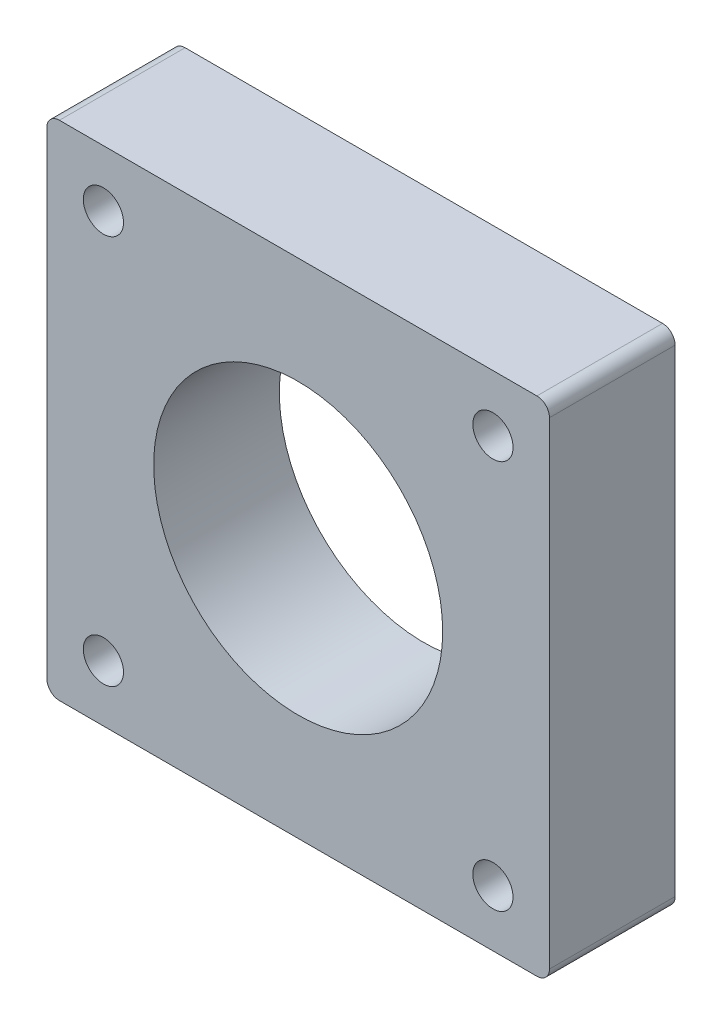
ISO-10303-21;
HEADER;
FILE_DESCRIPTION(('STEP AP214'),'2;1');
FILE_NAME('part.step','',(''),(''),'','','');
FILE_SCHEMA(('AUTOMOTIVE_DESIGN { 1 0 10303 214 1 1 1 1 }'));
ENDSEC;
DATA;
#1=APPLICATION_CONTEXT('core data for automotive mechanical design processes');
#2=APPLICATION_PROTOCOL_DEFINITION('international standard','automotive_design',2000,#1);
#3=PRODUCT_CONTEXT('',#1,'mechanical');
#4=PRODUCT('Part','Part','',(#3));
#5=PRODUCT_RELATED_PRODUCT_CATEGORY('part','',(#4));
#6=PRODUCT_DEFINITION_FORMATION('','',#4);
#7=PRODUCT_DEFINITION_CONTEXT('part definition',#1,'design');
#8=PRODUCT_DEFINITION('design','',#6,#7);
#9=PRODUCT_DEFINITION_SHAPE('','',#8);
#10=(LENGTH_UNIT() NAMED_UNIT(*) SI_UNIT(.MILLI.,.METRE.));
#11=(NAMED_UNIT(*) PLANE_ANGLE_UNIT() SI_UNIT($,.RADIAN.));
#12=(NAMED_UNIT(*) SI_UNIT($,.STERADIAN.) SOLID_ANGLE_UNIT());
#13=UNCERTAINTY_MEASURE_WITH_UNIT(LENGTH_MEASURE(1.E-05),#10,'distance_accuracy_value','');
#14=(GEOMETRIC_REPRESENTATION_CONTEXT(3) GLOBAL_UNCERTAINTY_ASSIGNED_CONTEXT((#13)) GLOBAL_UNIT_ASSIGNED_CONTEXT((#10,
#11,#12)) REPRESENTATION_CONTEXT('',''));
#15=CARTESIAN_POINT('',(0.,0.,0.));
#16=DIRECTION('',(0.,0.,1.));
#17=DIRECTION('',(1.,0.,0.));
#18=AXIS2_PLACEMENT_3D('',#15,#16,#17);
#19=CARTESIAN_POINT('',(-19.,-19.,10.));
#20=DIRECTION('',(0.,0.,1.));
#21=DIRECTION('',(1.,0.,0.));
#22=AXIS2_PLACEMENT_3D('',#19,#20,#21);
#23=PLANE('',#22);
#24=CARTESIAN_POINT('',(15.5,-15.5,10.));
#25=DIRECTION('',(0.,0.,1.));
#26=DIRECTION('',(1.,0.,0.));
#27=AXIS2_PLACEMENT_3D('',#24,#25,#26);
#28=CIRCLE('',#27,1.6);
#29=CARTESIAN_POINT('',(17.1,-15.5,10.));
#30=VERTEX_POINT('',#29);
#31=EDGE_CURVE('E194',#30,#30,#28,.T.);
#32=ORIENTED_EDGE('',*,*,#31,.F.);
#33=EDGE_LOOP('',(#32));
#34=FACE_BOUND('',#33,.T.);
#35=CARTESIAN_POINT('',(-15.5,15.5,10.));
#36=DIRECTION('',(0.,0.,1.));
#37=DIRECTION('',(1.,0.,0.));
#38=AXIS2_PLACEMENT_3D('',#35,#36,#37);
#39=CIRCLE('',#38,1.6);
#40=CARTESIAN_POINT('',(-13.9,15.5,10.));
#41=VERTEX_POINT('',#40);
#42=EDGE_CURVE('E182',#41,#41,#39,.T.);
#43=ORIENTED_EDGE('',*,*,#42,.F.);
#44=EDGE_LOOP('',(#43));
#45=FACE_BOUND('',#44,.T.);
#46=CARTESIAN_POINT('',(-19.,-19.,10.));
#47=DIRECTION('',(0.,0.,1.));
#48=DIRECTION('',(1.,0.,0.));
#49=AXIS2_PLACEMENT_3D('',#46,#47,#48);
#50=CIRCLE('',#49,1.);
#51=CARTESIAN_POINT('',(-20.,-19.,10.));
#52=VERTEX_POINT('',#51);
#53=CARTESIAN_POINT('',(-19.,-20.,10.));
#54=VERTEX_POINT('',#53);
#55=EDGE_CURVE('E145',#52,#54,#50,.T.);
#56=ORIENTED_EDGE('',*,*,#55,.T.);
#57=DIRECTION('',(1.,0.,0.));
#58=VECTOR('',#57,1.);
#59=CARTESIAN_POINT('',(-19.,-20.,10.));
#60=LINE('',#59,#58);
#61=CARTESIAN_POINT('',(19.,-20.,10.));
#62=VERTEX_POINT('',#61);
#63=EDGE_CURVE('E93',#54,#62,#60,.T.);
#64=ORIENTED_EDGE('',*,*,#63,.T.);
#65=CARTESIAN_POINT('',(19.,-19.,10.));
#66=DIRECTION('',(0.,0.,1.));
#67=DIRECTION('',(1.,0.,0.));
#68=AXIS2_PLACEMENT_3D('',#65,#66,#67);
#69=CIRCLE('',#68,1.);
#70=CARTESIAN_POINT('',(20.,-19.,10.));
#71=VERTEX_POINT('',#70);
#72=EDGE_CURVE('E160',#62,#71,#69,.T.);
#73=ORIENTED_EDGE('',*,*,#72,.T.);
#74=DIRECTION('',(0.,1.,0.));
#75=VECTOR('',#74,1.);
#76=CARTESIAN_POINT('',(20.,19.,10.));
#77=LINE('',#76,#75);
#78=CARTESIAN_POINT('',(20.,19.,10.));
#79=VERTEX_POINT('',#78);
#80=EDGE_CURVE('E173',#71,#79,#77,.T.);
#81=ORIENTED_EDGE('',*,*,#80,.T.);
#82=CARTESIAN_POINT('',(19.,19.,10.));
#83=DIRECTION('',(0.,0.,1.));
#84=DIRECTION('',(1.,0.,0.));
#85=AXIS2_PLACEMENT_3D('',#82,#83,#84);
#86=CIRCLE('',#85,1.);
#87=CARTESIAN_POINT('',(19.,20.,10.));
#88=VERTEX_POINT('',#87);
#89=EDGE_CURVE('E112',#79,#88,#86,.T.);
#90=ORIENTED_EDGE('',*,*,#89,.T.);
#91=DIRECTION('',(-1.,0.,0.));
#92=VECTOR('',#91,1.);
#93=CARTESIAN_POINT('',(-19.,20.,10.));
#94=LINE('',#93,#92);
#95=CARTESIAN_POINT('',(-19.,20.,10.));
#96=VERTEX_POINT('',#95);
#97=EDGE_CURVE('E106',#88,#96,#94,.T.);
#98=ORIENTED_EDGE('',*,*,#97,.T.);
#99=CARTESIAN_POINT('',(-19.,19.,10.));
#100=DIRECTION('',(0.,0.,1.));
#101=DIRECTION('',(-1.,0.,0.));
#102=AXIS2_PLACEMENT_3D('',#99,#100,#101);
#103=CIRCLE('',#102,1.);
#104=CARTESIAN_POINT('',(-20.,19.,10.));
#105=VERTEX_POINT('',#104);
#106=EDGE_CURVE('E110',#96,#105,#103,.T.);
#107=ORIENTED_EDGE('',*,*,#106,.T.);
#108=DIRECTION('',(0.,-1.,0.));
#109=VECTOR('',#108,1.);
#110=CARTESIAN_POINT('',(-20.,19.,10.));
#111=LINE('',#110,#109);
#112=EDGE_CURVE('E50',#105,#52,#111,.T.);
#113=ORIENTED_EDGE('',*,*,#112,.T.);
#114=EDGE_LOOP('',(#56,#64,#73,#81,#90,#98,#107,#113));
#115=FACE_BOUND('',#114,.T.);
#116=CARTESIAN_POINT('',(0.,0.,10.));
#117=DIRECTION('',(0.,0.,1.));
#118=DIRECTION('',(1.,0.,0.));
#119=AXIS2_PLACEMENT_3D('',#116,#117,#118);
#120=CIRCLE('',#119,11.5);
#121=CARTESIAN_POINT('',(11.5,0.,10.));
#122=VERTEX_POINT('',#121);
#123=EDGE_CURVE('E134',#122,#122,#120,.T.);
#124=ORIENTED_EDGE('',*,*,#123,.F.);
#125=EDGE_LOOP('',(#124));
#126=FACE_BOUND('',#125,.T.);
#127=CARTESIAN_POINT('',(15.5,15.5,10.));
#128=DIRECTION('',(0.,0.,1.));
#129=DIRECTION('',(1.,0.,0.));
#130=AXIS2_PLACEMENT_3D('',#127,#128,#129);
#131=CIRCLE('',#130,1.6);
#132=CARTESIAN_POINT('',(17.1,15.5,10.));
#133=VERTEX_POINT('',#132);
#134=EDGE_CURVE('E188',#133,#133,#131,.T.);
#135=ORIENTED_EDGE('',*,*,#134,.F.);
#136=EDGE_LOOP('',(#135));
#137=FACE_BOUND('',#136,.T.);
#138=CARTESIAN_POINT('',(-15.5,-15.5,10.));
#139=DIRECTION('',(0.,0.,1.));
#140=DIRECTION('',(1.,0.,0.));
#141=AXIS2_PLACEMENT_3D('',#138,#139,#140);
#142=CIRCLE('',#141,1.6);
#143=CARTESIAN_POINT('',(-13.9,-15.5,10.));
#144=VERTEX_POINT('',#143);
#145=EDGE_CURVE('E200',#144,#144,#142,.T.);
#146=ORIENTED_EDGE('',*,*,#145,.F.);
#147=EDGE_LOOP('',(#146));
#148=FACE_BOUND('',#147,.T.);
#149=ADVANCED_FACE('F33',(#34,#45,#115,#126,#137,#148),#23,.T.);
#150=CARTESIAN_POINT('',(-19.,-19.,0.));
#151=DIRECTION('',(0.,0.,1.));
#152=DIRECTION('',(1.,0.,0.));
#153=AXIS2_PLACEMENT_3D('',#150,#151,#152);
#154=PLANE('',#153);
#155=CARTESIAN_POINT('',(15.5,-15.5,0.));
#156=DIRECTION('',(0.,0.,1.));
#157=DIRECTION('',(1.,0.,0.));
#158=AXIS2_PLACEMENT_3D('',#155,#156,#157);
#159=CIRCLE('',#158,1.6);
#160=CARTESIAN_POINT('',(17.1,-15.5,0.));
#161=VERTEX_POINT('',#160);
#162=EDGE_CURVE('E197',#161,#161,#159,.T.);
#163=ORIENTED_EDGE('',*,*,#162,.T.);
#164=EDGE_LOOP('',(#163));
#165=FACE_BOUND('',#164,.T.);
#166=CARTESIAN_POINT('',(-15.5,15.5,0.));
#167=DIRECTION('',(0.,0.,1.));
#168=DIRECTION('',(1.,0.,0.));
#169=AXIS2_PLACEMENT_3D('',#166,#167,#168);
#170=CIRCLE('',#169,1.6);
#171=CARTESIAN_POINT('',(-13.9,15.5,0.));
#172=VERTEX_POINT('',#171);
#173=EDGE_CURVE('E185',#172,#172,#170,.T.);
#174=ORIENTED_EDGE('',*,*,#173,.T.);
#175=EDGE_LOOP('',(#174));
#176=FACE_BOUND('',#175,.T.);
#177=CARTESIAN_POINT('',(-19.,-19.,0.));
#178=DIRECTION('',(0.,0.,1.));
#179=DIRECTION('',(1.,0.,0.));
#180=AXIS2_PLACEMENT_3D('',#177,#178,#179);
#181=CIRCLE('',#180,1.);
#182=CARTESIAN_POINT('',(-20.,-19.,0.));
#183=VERTEX_POINT('',#182);
#184=CARTESIAN_POINT('',(-19.,-20.,0.));
#185=VERTEX_POINT('',#184);
#186=EDGE_CURVE('E130',#183,#185,#181,.T.);
#187=ORIENTED_EDGE('',*,*,#186,.F.);
#188=DIRECTION('',(0.,-1.,0.));
#189=VECTOR('',#188,1.);
#190=CARTESIAN_POINT('',(-20.,19.,0.));
#191=LINE('',#190,#189);
#192=CARTESIAN_POINT('',(-20.,19.,0.));
#193=VERTEX_POINT('',#192);
#194=EDGE_CURVE('E85',#193,#183,#191,.T.);
#195=ORIENTED_EDGE('',*,*,#194,.F.);
#196=CARTESIAN_POINT('',(-19.,19.,0.));
#197=DIRECTION('',(0.,0.,1.));
#198=DIRECTION('',(-1.,0.,0.));
#199=AXIS2_PLACEMENT_3D('',#196,#197,#198);
#200=CIRCLE('',#199,1.);
#201=CARTESIAN_POINT('',(-19.,20.,0.));
#202=VERTEX_POINT('',#201);
#203=EDGE_CURVE('E79',#202,#193,#200,.T.);
#204=ORIENTED_EDGE('',*,*,#203,.F.);
#205=DIRECTION('',(-1.,0.,0.));
#206=VECTOR('',#205,1.);
#207=CARTESIAN_POINT('',(-19.,20.,0.));
#208=LINE('',#207,#206);
#209=CARTESIAN_POINT('',(19.,20.,0.));
#210=VERTEX_POINT('',#209);
#211=EDGE_CURVE('E120',#210,#202,#208,.T.);
#212=ORIENTED_EDGE('',*,*,#211,.F.);
#213=CARTESIAN_POINT('',(19.,19.,0.));
#214=DIRECTION('',(0.,0.,1.));
#215=DIRECTION('',(1.,0.,0.));
#216=AXIS2_PLACEMENT_3D('',#213,#214,#215);
#217=CIRCLE('',#216,1.);
#218=CARTESIAN_POINT('',(20.,19.,0.));
#219=VERTEX_POINT('',#218);
#220=EDGE_CURVE('E140',#219,#210,#217,.T.);
#221=ORIENTED_EDGE('',*,*,#220,.F.);
#222=DIRECTION('',(0.,1.,0.));
#223=VECTOR('',#222,1.);
#224=CARTESIAN_POINT('',(20.,19.,0.));
#225=LINE('',#224,#223);
#226=CARTESIAN_POINT('',(20.,-19.,0.));
#227=VERTEX_POINT('',#226);
#228=EDGE_CURVE('E138',#227,#219,#225,.T.);
#229=ORIENTED_EDGE('',*,*,#228,.F.);
#230=CARTESIAN_POINT('',(19.,-19.,0.));
#231=DIRECTION('',(0.,0.,1.));
#232=DIRECTION('',(1.,0.,0.));
#233=AXIS2_PLACEMENT_3D('',#230,#231,#232);
#234=CIRCLE('',#233,1.);
#235=CARTESIAN_POINT('',(19.,-20.,0.));
#236=VERTEX_POINT('',#235);
#237=EDGE_CURVE('E136',#236,#227,#234,.T.);
#238=ORIENTED_EDGE('',*,*,#237,.F.);
#239=DIRECTION('',(1.,0.,0.));
#240=VECTOR('',#239,1.);
#241=CARTESIAN_POINT('',(-19.,-20.,0.));
#242=LINE('',#241,#240);
#243=EDGE_CURVE('E133',#185,#236,#242,.T.);
#244=ORIENTED_EDGE('',*,*,#243,.F.);
#245=EDGE_LOOP('',(#187,#195,#204,#212,#221,#229,#238,#244));
#246=FACE_BOUND('',#245,.T.);
#247=CARTESIAN_POINT('',(0.,0.,0.));
#248=DIRECTION('',(0.,0.,1.));
#249=DIRECTION('',(1.,0.,0.));
#250=AXIS2_PLACEMENT_3D('',#247,#248,#249);
#251=CIRCLE('',#250,11.5);
#252=CARTESIAN_POINT('',(11.5,0.,0.));
#253=VERTEX_POINT('',#252);
#254=EDGE_CURVE('E179',#253,#253,#251,.T.);
#255=ORIENTED_EDGE('',*,*,#254,.T.);
#256=EDGE_LOOP('',(#255));
#257=FACE_BOUND('',#256,.T.);
#258=CARTESIAN_POINT('',(15.5,15.5,0.));
#259=DIRECTION('',(0.,0.,1.));
#260=DIRECTION('',(1.,0.,0.));
#261=AXIS2_PLACEMENT_3D('',#258,#259,#260);
#262=CIRCLE('',#261,1.6);
#263=CARTESIAN_POINT('',(17.1,15.5,0.));
#264=VERTEX_POINT('',#263);
#265=EDGE_CURVE('E191',#264,#264,#262,.T.);
#266=ORIENTED_EDGE('',*,*,#265,.T.);
#267=EDGE_LOOP('',(#266));
#268=FACE_BOUND('',#267,.T.);
#269=CARTESIAN_POINT('',(-15.5,-15.5,0.));
#270=DIRECTION('',(0.,0.,1.));
#271=DIRECTION('',(1.,0.,0.));
#272=AXIS2_PLACEMENT_3D('',#269,#270,#271);
#273=CIRCLE('',#272,1.6);
#274=CARTESIAN_POINT('',(-13.9,-15.5,0.));
#275=VERTEX_POINT('',#274);
#276=EDGE_CURVE('E203',#275,#275,#273,.T.);
#277=ORIENTED_EDGE('',*,*,#276,.T.);
#278=EDGE_LOOP('',(#277));
#279=FACE_BOUND('',#278,.T.);
#280=ADVANCED_FACE('F164',(#165,#176,#246,#257,#268,#279),#154,.F.);
#281=CARTESIAN_POINT('',(-19.,-19.,10.));
#282=DIRECTION('',(0.,0.,-1.));
#283=DIRECTION('',(-1.,0.,0.));
#284=AXIS2_PLACEMENT_3D('',#281,#282,#283);
#285=CYLINDRICAL_SURFACE('',#284,1.);
#286=ORIENTED_EDGE('',*,*,#186,.T.);
#287=DIRECTION('',(0.,0.,-1.));
#288=VECTOR('',#287,1.);
#289=CARTESIAN_POINT('',(-19.,-20.,10.));
#290=LINE('',#289,#288);
#291=EDGE_CURVE('E11',#54,#185,#290,.T.);
#292=ORIENTED_EDGE('',*,*,#291,.F.);
#293=ORIENTED_EDGE('',*,*,#55,.F.);
#294=DIRECTION('',(0.,0.,-1.));
#295=VECTOR('',#294,1.);
#296=CARTESIAN_POINT('',(-20.,-19.,10.));
#297=LINE('',#296,#295);
#298=EDGE_CURVE('E126',#52,#183,#297,.T.);
#299=ORIENTED_EDGE('',*,*,#298,.T.);
#300=EDGE_LOOP('',(#286,#292,#293,#299));
#301=FACE_BOUND('',#300,.T.);
#302=ADVANCED_FACE('F35',(#301),#285,.T.);
#303=CARTESIAN_POINT('',(-19.,-20.,10.));
#304=DIRECTION('',(0.,1.,0.));
#305=DIRECTION('',(0.,0.,1.));
#306=AXIS2_PLACEMENT_3D('',#303,#304,#305);
#307=PLANE('',#306);
#308=ORIENTED_EDGE('',*,*,#243,.T.);
#309=DIRECTION('',(0.,0.,-1.));
#310=VECTOR('',#309,1.);
#311=CARTESIAN_POINT('',(19.,-20.,10.));
#312=LINE('',#311,#310);
#313=EDGE_CURVE('E42',#62,#236,#312,.T.);
#314=ORIENTED_EDGE('',*,*,#313,.F.);
#315=ORIENTED_EDGE('',*,*,#63,.F.);
#316=ORIENTED_EDGE('',*,*,#291,.T.);
#317=EDGE_LOOP('',(#308,#314,#315,#316));
#318=FACE_BOUND('',#317,.T.);
#319=ADVANCED_FACE('F238',(#318),#307,.F.);
#320=CARTESIAN_POINT('',(19.,-19.,10.));
#321=DIRECTION('',(0.,0.,-1.));
#322=DIRECTION('',(-1.,0.,0.));
#323=AXIS2_PLACEMENT_3D('',#320,#321,#322);
#324=CYLINDRICAL_SURFACE('',#323,1.);
#325=ORIENTED_EDGE('',*,*,#237,.T.);
#326=DIRECTION('',(0.,0.,-1.));
#327=VECTOR('',#326,1.);
#328=CARTESIAN_POINT('',(20.,-19.,10.));
#329=LINE('',#328,#327);
#330=EDGE_CURVE('E152',#71,#227,#329,.T.);
#331=ORIENTED_EDGE('',*,*,#330,.F.);
#332=ORIENTED_EDGE('',*,*,#72,.F.);
#333=ORIENTED_EDGE('',*,*,#313,.T.);
#334=EDGE_LOOP('',(#325,#331,#332,#333));
#335=FACE_BOUND('',#334,.T.);
#336=ADVANCED_FACE('F158',(#335),#324,.T.);
#337=CARTESIAN_POINT('',(20.,19.,10.));
#338=DIRECTION('',(-1.,0.,0.));
#339=DIRECTION('',(0.,0.,1.));
#340=AXIS2_PLACEMENT_3D('',#337,#338,#339);
#341=PLANE('',#340);
#342=ORIENTED_EDGE('',*,*,#228,.T.);
#343=DIRECTION('',(0.,0.,-1.));
#344=VECTOR('',#343,1.);
#345=CARTESIAN_POINT('',(20.,19.,10.));
#346=LINE('',#345,#344);
#347=EDGE_CURVE('E149',#79,#219,#346,.T.);
#348=ORIENTED_EDGE('',*,*,#347,.F.);
#349=ORIENTED_EDGE('',*,*,#80,.F.);
#350=ORIENTED_EDGE('',*,*,#330,.T.);
#351=EDGE_LOOP('',(#342,#348,#349,#350));
#352=FACE_BOUND('',#351,.T.);
#353=ADVANCED_FACE('F169',(#352),#341,.F.);
#354=CARTESIAN_POINT('',(19.,19.,10.));
#355=DIRECTION('',(0.,0.,-1.));
#356=DIRECTION('',(-1.,0.,0.));
#357=AXIS2_PLACEMENT_3D('',#354,#355,#356);
#358=CYLINDRICAL_SURFACE('',#357,1.);
#359=ORIENTED_EDGE('',*,*,#220,.T.);
#360=DIRECTION('',(0.,0.,-1.));
#361=VECTOR('',#360,1.);
#362=CARTESIAN_POINT('',(19.,20.,10.));
#363=LINE('',#362,#361);
#364=EDGE_CURVE('E121',#88,#210,#363,.T.);
#365=ORIENTED_EDGE('',*,*,#364,.F.);
#366=ORIENTED_EDGE('',*,*,#89,.F.);
#367=ORIENTED_EDGE('',*,*,#347,.T.);
#368=EDGE_LOOP('',(#359,#365,#366,#367));
#369=FACE_BOUND('',#368,.T.);
#370=ADVANCED_FACE('F172',(#369),#358,.T.);
#371=CARTESIAN_POINT('',(-19.,20.,10.));
#372=DIRECTION('',(0.,-1.,0.));
#373=DIRECTION('',(0.,0.,-1.));
#374=AXIS2_PLACEMENT_3D('',#371,#372,#373);
#375=PLANE('',#374);
#376=ORIENTED_EDGE('',*,*,#211,.T.);
#377=DIRECTION('',(0.,0.,-1.));
#378=VECTOR('',#377,1.);
#379=CARTESIAN_POINT('',(-19.,20.,10.));
#380=LINE('',#379,#378);
#381=EDGE_CURVE('E117',#96,#202,#380,.T.);
#382=ORIENTED_EDGE('',*,*,#381,.F.);
#383=ORIENTED_EDGE('',*,*,#97,.F.);
#384=ORIENTED_EDGE('',*,*,#364,.T.);
#385=EDGE_LOOP('',(#376,#382,#383,#384));
#386=FACE_BOUND('',#385,.T.);
#387=ADVANCED_FACE('F118',(#386),#375,.F.);
#388=CARTESIAN_POINT('',(-19.,19.,10.));
#389=DIRECTION('',(0.,0.,-1.));
#390=DIRECTION('',(-1.,0.,0.));
#391=AXIS2_PLACEMENT_3D('',#388,#389,#390);
#392=CYLINDRICAL_SURFACE('',#391,1.);
#393=ORIENTED_EDGE('',*,*,#203,.T.);
#394=DIRECTION('',(0.,0.,-1.));
#395=VECTOR('',#394,1.);
#396=CARTESIAN_POINT('',(-20.,19.,10.));
#397=LINE('',#396,#395);
#398=EDGE_CURVE('E122',#105,#193,#397,.T.);
#399=ORIENTED_EDGE('',*,*,#398,.F.);
#400=ORIENTED_EDGE('',*,*,#106,.F.);
#401=ORIENTED_EDGE('',*,*,#381,.T.);
#402=EDGE_LOOP('',(#393,#399,#400,#401));
#403=FACE_BOUND('',#402,.T.);
#404=ADVANCED_FACE('F124',(#403),#392,.T.);
#405=CARTESIAN_POINT('',(-20.,19.,10.));
#406=DIRECTION('',(1.,0.,0.));
#407=DIRECTION('',(0.,0.,-1.));
#408=AXIS2_PLACEMENT_3D('',#405,#406,#407);
#409=PLANE('',#408);
#410=ORIENTED_EDGE('',*,*,#194,.T.);
#411=ORIENTED_EDGE('',*,*,#298,.F.);
#412=ORIENTED_EDGE('',*,*,#112,.F.);
#413=ORIENTED_EDGE('',*,*,#398,.T.);
#414=EDGE_LOOP('',(#410,#411,#412,#413));
#415=FACE_BOUND('',#414,.T.);
#416=ADVANCED_FACE('F226',(#415),#409,.F.);
#417=CARTESIAN_POINT('',(0.,0.,10.));
#418=DIRECTION('',(0.,0.,-1.));
#419=DIRECTION('',(-1.,0.,0.));
#420=AXIS2_PLACEMENT_3D('',#417,#418,#419);
#421=CYLINDRICAL_SURFACE('',#420,11.5);
#422=ORIENTED_EDGE('',*,*,#123,.T.);
#423=EDGE_LOOP('',(#422));
#424=FACE_BOUND('',#423,.T.);
#425=ORIENTED_EDGE('',*,*,#254,.F.);
#426=EDGE_LOOP('',(#425));
#427=FACE_BOUND('',#426,.T.);
#428=ADVANCED_FACE('F223',(#424,#427),#421,.F.);
#429=CARTESIAN_POINT('',(-15.5,15.5,10.));
#430=DIRECTION('',(0.,0.,-1.));
#431=DIRECTION('',(-1.,0.,0.));
#432=AXIS2_PLACEMENT_3D('',#429,#430,#431);
#433=CYLINDRICAL_SURFACE('',#432,1.6);
#434=ORIENTED_EDGE('',*,*,#42,.T.);
#435=EDGE_LOOP('',(#434));
#436=FACE_BOUND('',#435,.T.);
#437=ORIENTED_EDGE('',*,*,#173,.F.);
#438=EDGE_LOOP('',(#437));
#439=FACE_BOUND('',#438,.T.);
#440=ADVANCED_FACE('F302',(#436,#439),#433,.F.);
#441=CARTESIAN_POINT('',(15.5,15.5,10.));
#442=DIRECTION('',(0.,0.,-1.));
#443=DIRECTION('',(-1.,0.,0.));
#444=AXIS2_PLACEMENT_3D('',#441,#442,#443);
#445=CYLINDRICAL_SURFACE('',#444,1.6);
#446=ORIENTED_EDGE('',*,*,#134,.T.);
#447=EDGE_LOOP('',(#446));
#448=FACE_BOUND('',#447,.T.);
#449=ORIENTED_EDGE('',*,*,#265,.F.);
#450=EDGE_LOOP('',(#449));
#451=FACE_BOUND('',#450,.T.);
#452=ADVANCED_FACE('F310',(#448,#451),#445,.F.);
#453=CARTESIAN_POINT('',(15.5,-15.5,10.));
#454=DIRECTION('',(0.,0.,-1.));
#455=DIRECTION('',(-1.,0.,0.));
#456=AXIS2_PLACEMENT_3D('',#453,#454,#455);
#457=CYLINDRICAL_SURFACE('',#456,1.6);
#458=ORIENTED_EDGE('',*,*,#31,.T.);
#459=EDGE_LOOP('',(#458));
#460=FACE_BOUND('',#459,.T.);
#461=ORIENTED_EDGE('',*,*,#162,.F.);
#462=EDGE_LOOP('',(#461));
#463=FACE_BOUND('',#462,.T.);
#464=ADVANCED_FACE('F318',(#460,#463),#457,.F.);
#465=CARTESIAN_POINT('',(-15.5,-15.5,10.));
#466=DIRECTION('',(0.,0.,-1.));
#467=DIRECTION('',(-1.,0.,0.));
#468=AXIS2_PLACEMENT_3D('',#465,#466,#467);
#469=CYLINDRICAL_SURFACE('',#468,1.6);
#470=ORIENTED_EDGE('',*,*,#145,.T.);
#471=EDGE_LOOP('',(#470));
#472=FACE_BOUND('',#471,.T.);
#473=ORIENTED_EDGE('',*,*,#276,.F.);
#474=EDGE_LOOP('',(#473));
#475=FACE_BOUND('',#474,.T.);
#476=ADVANCED_FACE('F209',(#472,#475),#469,.F.);
#477=CLOSED_SHELL('',(#149,#280,#302,#319,#336,#353,#370,#387,#404,#416,#428,#440,#452,#464,#476));
#478=MANIFOLD_SOLID_BREP('B2',#477);
#479=ADVANCED_BREP_SHAPE_REPRESENTATION('',(#18,#478),#14);
#480=SHAPE_DEFINITION_REPRESENTATION(#9,#479);
ENDSEC;
END-ISO-10303-21;
